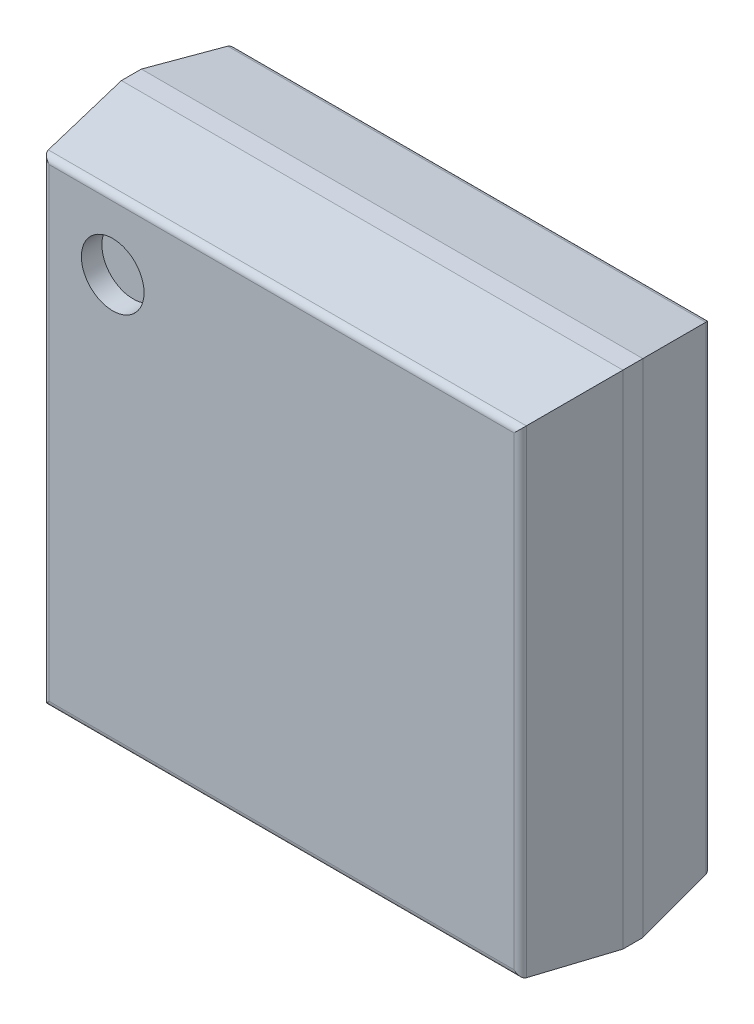
ISO-10303-21;
HEADER;
FILE_DESCRIPTION(('STEP AP214'),'2;1');
FILE_NAME('part.step','',(''),(''),'','','');
FILE_SCHEMA(('AUTOMOTIVE_DESIGN { 1 0 10303 214 1 1 1 1 }'));
ENDSEC;
DATA;
#1=APPLICATION_CONTEXT('core data for automotive mechanical design processes');
#2=APPLICATION_PROTOCOL_DEFINITION('international standard','automotive_design',2000,#1);
#3=PRODUCT_CONTEXT('',#1,'mechanical');
#4=PRODUCT('Part','Part','',(#3));
#5=PRODUCT_RELATED_PRODUCT_CATEGORY('part','',(#4));
#6=PRODUCT_DEFINITION_FORMATION('','',#4);
#7=PRODUCT_DEFINITION_CONTEXT('part definition',#1,'design');
#8=PRODUCT_DEFINITION('design','',#6,#7);
#9=PRODUCT_DEFINITION_SHAPE('','',#8);
#10=(LENGTH_UNIT() NAMED_UNIT(*) SI_UNIT(.MILLI.,.METRE.));
#11=(NAMED_UNIT(*) PLANE_ANGLE_UNIT() SI_UNIT($,.RADIAN.));
#12=(NAMED_UNIT(*) SI_UNIT($,.STERADIAN.) SOLID_ANGLE_UNIT());
#13=UNCERTAINTY_MEASURE_WITH_UNIT(LENGTH_MEASURE(1.E-05),#10,'distance_accuracy_value','');
#14=(GEOMETRIC_REPRESENTATION_CONTEXT(3) GLOBAL_UNCERTAINTY_ASSIGNED_CONTEXT((#13)) GLOBAL_UNIT_ASSIGNED_CONTEXT((#10,
#11,#12)) REPRESENTATION_CONTEXT('',''));
#15=CARTESIAN_POINT('',(0.,0.,0.));
#16=DIRECTION('',(0.,0.,1.));
#17=DIRECTION('',(1.,0.,0.));
#18=AXIS2_PLACEMENT_3D('',#15,#16,#17);
#19=CARTESIAN_POINT('',(-1.77975,1.77975,1.944));
#20=DIRECTION('',(0.,0.,1.));
#21=DIRECTION('',(1.,0.,0.));
#22=AXIS2_PLACEMENT_3D('',#19,#20,#21);
#23=PLANE('',#22);
#24=CARTESIAN_POINT('',(-1.77975,1.77975,1.944));
#25=DIRECTION('',(0.,0.,1.));
#26=DIRECTION('',(1.,0.,0.));
#27=AXIS2_PLACEMENT_3D('',#24,#25,#26);
#28=CIRCLE('',#27,0.3303125);
#29=CARTESIAN_POINT('',(-1.4494375,1.77975,1.944));
#30=VERTEX_POINT('',#29);
#31=EDGE_CURVE('E11',#30,#30,#28,.T.);
#32=ORIENTED_EDGE('',*,*,#31,.T.);
#33=EDGE_LOOP('',(#32));
#34=FACE_BOUND('',#33,.T.);
#35=ADVANCED_FACE('F17',(#34),#23,.T.);
#36=CARTESIAN_POINT('',(-1.77975,1.77975,1.944));
#37=DIRECTION('',(0.,0.,1.));
#38=DIRECTION('',(1.,0.,0.));
#39=AXIS2_PLACEMENT_3D('',#36,#37,#38);
#40=CYLINDRICAL_SURFACE('',#39,0.3303125);
#41=DIRECTION('',(0.,0.,1.));
#42=VECTOR('',#41,1.);
#43=CARTESIAN_POINT('',(-1.4494375,1.77975,1.944));
#44=LINE('',#43,#42);
#45=CARTESIAN_POINT('',(-1.4494375,1.77975,2.16));
#46=VERTEX_POINT('',#45);
#47=EDGE_CURVE('E25',#30,#46,#44,.T.);
#48=ORIENTED_EDGE('',*,*,#47,.T.);
#49=CARTESIAN_POINT('',(-1.77975,1.77975,2.16));
#50=DIRECTION('',(0.,0.,1.));
#51=DIRECTION('',(1.,0.,0.));
#52=AXIS2_PLACEMENT_3D('',#49,#50,#51);
#53=CIRCLE('',#52,0.3303125);
#54=EDGE_CURVE('E216',#46,#46,#53,.T.);
#55=ORIENTED_EDGE('',*,*,#54,.T.);
#56=ORIENTED_EDGE('',*,*,#47,.F.);
#57=ORIENTED_EDGE('',*,*,#31,.F.);
#58=EDGE_LOOP('',(#48,#55,#56,#57));
#59=FACE_BOUND('',#58,.T.);
#60=ADVANCED_FACE('F708',(#59),#40,.F.);
#61=CARTESIAN_POINT('',(2.449399371753,-2.510375,2.09));
#62=DIRECTION('',(0.,1.,0.));
#63=DIRECTION('',(0.,0.,1.));
#64=AXIS2_PLACEMENT_3D('',#61,#62,#63);
#65=CYLINDRICAL_SURFACE('',#64,0.07);
#66=CARTESIAN_POINT('',(2.449399371753,-2.449399371753,2.09));
#67=DIRECTION('',(-0.707106781186548,-0.707106781186548,0.));
#68=DIRECTION('',(0.707106781186548,-0.707106781186548,0.));
#69=AXIS2_PLACEMENT_3D('',#66,#67,#68);
#70=ELLIPSE('',#69,0.09899494936612,0.07);
#71=CARTESIAN_POINT('',(2.518737880459,-2.518737880459,2.099600583856));
#72=VERTEX_POINT('',#71);
#73=CARTESIAN_POINT('',(2.449399371753,-2.449399371753,2.16));
#74=VERTEX_POINT('',#73);
#75=EDGE_CURVE('E192',#72,#74,#70,.T.);
#76=ORIENTED_EDGE('',*,*,#75,.F.);
#77=DIRECTION('',(0.,1.,0.));
#78=VECTOR('',#77,1.);
#79=CARTESIAN_POINT('',(2.518737880459,-2.510375,2.099600583856));
#80=LINE('',#79,#78);
#81=CARTESIAN_POINT('',(2.518737880459,2.518737880459,2.099600583856));
#82=VERTEX_POINT('',#81);
#83=EDGE_CURVE('E189',#72,#82,#80,.T.);
#84=ORIENTED_EDGE('',*,*,#83,.T.);
#85=CARTESIAN_POINT('',(2.449399371753,2.449399371753,2.09));
#86=DIRECTION('',(-0.707106781186548,0.707106781186548,0.));
#87=DIRECTION('',(0.707106781186548,0.707106781186548,0.));
#88=AXIS2_PLACEMENT_3D('',#85,#86,#87);
#89=ELLIPSE('',#88,0.09899494936612,0.07);
#90=CARTESIAN_POINT('',(2.449399371753,2.449399371753,2.16));
#91=VERTEX_POINT('',#90);
#92=EDGE_CURVE('E213',#91,#82,#89,.T.);
#93=ORIENTED_EDGE('',*,*,#92,.F.);
#94=DIRECTION('',(0.,1.,0.));
#95=VECTOR('',#94,1.);
#96=CARTESIAN_POINT('',(2.449399371753,-2.510375,2.16));
#97=LINE('',#96,#95);
#98=EDGE_CURVE('E207',#74,#91,#97,.T.);
#99=ORIENTED_EDGE('',*,*,#98,.F.);
#100=EDGE_LOOP('',(#76,#84,#93,#99));
#101=FACE_BOUND('',#100,.T.);
#102=ADVANCED_FACE('F697',(#101),#65,.T.);
#103=CARTESIAN_POINT('',(-2.510375,2.449399371753,2.09));
#104=DIRECTION('',(1.,0.,0.));
#105=DIRECTION('',(0.,0.,1.));
#106=AXIS2_PLACEMENT_3D('',#103,#104,#105);
#107=CYLINDRICAL_SURFACE('',#106,0.07);
#108=DIRECTION('',(1.,0.,0.));
#109=VECTOR('',#108,1.);
#110=CARTESIAN_POINT('',(-2.510375,2.449399371753,2.16));
#111=LINE('',#110,#109);
#112=CARTESIAN_POINT('',(-2.449399371753,2.449399371753,2.16));
#113=VERTEX_POINT('',#112);
#114=EDGE_CURVE('E210',#113,#91,#111,.T.);
#115=ORIENTED_EDGE('',*,*,#114,.T.);
#116=ORIENTED_EDGE('',*,*,#92,.T.);
#117=DIRECTION('',(1.,0.,0.));
#118=VECTOR('',#117,1.);
#119=CARTESIAN_POINT('',(-2.510375,2.518737880459,2.099600583856));
#120=LINE('',#119,#118);
#121=CARTESIAN_POINT('',(-2.518737880459,2.518737880459,2.099600583856));
#122=VERTEX_POINT('',#121);
#123=EDGE_CURVE('E316',#122,#82,#120,.T.);
#124=ORIENTED_EDGE('',*,*,#123,.F.);
#125=CARTESIAN_POINT('',(-2.449399371753,2.449399371753,2.09));
#126=DIRECTION('',(0.707106781186548,0.707106781186548,0.));
#127=DIRECTION('',(-0.707106781186548,0.707106781186548,0.));
#128=AXIS2_PLACEMENT_3D('',#125,#126,#127);
#129=ELLIPSE('',#128,0.09899494936612,0.07);
#130=EDGE_CURVE('E320',#122,#113,#129,.T.);
#131=ORIENTED_EDGE('',*,*,#130,.T.);
#132=EDGE_LOOP('',(#115,#116,#124,#131));
#133=FACE_BOUND('',#132,.T.);
#134=ADVANCED_FACE('F687',(#133),#107,.T.);
#135=CARTESIAN_POINT('',(-2.6425,-2.6425,2.16));
#136=DIRECTION('',(0.,0.,1.));
#137=DIRECTION('',(1.,0.,0.));
#138=AXIS2_PLACEMENT_3D('',#135,#136,#137);
#139=PLANE('',#138);
#140=ORIENTED_EDGE('',*,*,#54,.F.);
#141=EDGE_LOOP('',(#140));
#142=FACE_BOUND('',#141,.T.);
#143=DIRECTION('',(0.,1.,0.));
#144=VECTOR('',#143,1.);
#145=CARTESIAN_POINT('',(-2.449399371753,-2.510375,2.16));
#146=LINE('',#145,#144);
#147=CARTESIAN_POINT('',(-2.449399371753,-2.449399371753,2.16));
#148=VERTEX_POINT('',#147);
#149=EDGE_CURVE('E283',#148,#113,#146,.T.);
#150=ORIENTED_EDGE('',*,*,#149,.F.);
#151=DIRECTION('',(1.,0.,0.));
#152=VECTOR('',#151,1.);
#153=CARTESIAN_POINT('',(-2.510375,-2.449399371753,2.16));
#154=LINE('',#153,#152);
#155=EDGE_CURVE('E211',#148,#74,#154,.T.);
#156=ORIENTED_EDGE('',*,*,#155,.T.);
#157=ORIENTED_EDGE('',*,*,#98,.T.);
#158=ORIENTED_EDGE('',*,*,#114,.F.);
#159=EDGE_LOOP('',(#150,#156,#157,#158));
#160=FACE_BOUND('',#159,.T.);
#161=ADVANCED_FACE('F676',(#142,#160),#139,.T.);
#162=CARTESIAN_POINT('',(-2.510375,-2.449399371753,2.09));
#163=DIRECTION('',(1.,0.,0.));
#164=DIRECTION('',(0.,-0.990550124377165,0.137151197940023));
#165=AXIS2_PLACEMENT_3D('',#162,#163,#164);
#166=CYLINDRICAL_SURFACE('',#165,0.07);
#167=DIRECTION('',(1.,0.,0.));
#168=VECTOR('',#167,1.);
#169=CARTESIAN_POINT('',(-2.510375,-2.518737880459,2.099600583856));
#170=LINE('',#169,#168);
#171=CARTESIAN_POINT('',(-2.518737880459,-2.518737880459,2.099600583856));
#172=VERTEX_POINT('',#171);
#173=EDGE_CURVE('E263',#172,#72,#170,.T.);
#174=ORIENTED_EDGE('',*,*,#173,.T.);
#175=ORIENTED_EDGE('',*,*,#75,.T.);
#176=ORIENTED_EDGE('',*,*,#155,.F.);
#177=CARTESIAN_POINT('',(-2.449399371753,-2.449399371753,2.09));
#178=DIRECTION('',(-0.707106781186548,0.707106781186548,0.));
#179=DIRECTION('',(0.707106781186548,0.707106781186548,0.));
#180=AXIS2_PLACEMENT_3D('',#177,#178,#179);
#181=ELLIPSE('',#180,0.09899494936612,0.07);
#182=EDGE_CURVE('E267',#172,#148,#181,.T.);
#183=ORIENTED_EDGE('',*,*,#182,.F.);
#184=EDGE_LOOP('',(#174,#175,#176,#183));
#185=FACE_BOUND('',#184,.T.);
#186=ADVANCED_FACE('F665',(#185),#166,.T.);
#187=CARTESIAN_POINT('',(2.5764375,-2.6425,1.682875347978));
#188=DIRECTION('',(0.990550124377165,0.,0.137151197940023));
#189=DIRECTION('',(0.,-1.,0.));
#190=AXIS2_PLACEMENT_3D('',#187,#188,#189);
#191=PLANE('',#190);
#192=DIRECTION('',(-0.135879177577958,0.135879177577958,0.981363183638695));
#193=VECTOR('',#192,1.);
#194=CARTESIAN_POINT('',(2.528868345655,-2.528868345655,2.026435101453));
#195=LINE('',#194,#193);
#196=CARTESIAN_POINT('',(2.6425,-2.6425,1.205750695955));
#197=VERTEX_POINT('',#196);
#198=EDGE_CURVE('E268',#197,#72,#195,.T.);
#199=ORIENTED_EDGE('',*,*,#198,.F.);
#200=DIRECTION('',(0.,1.,0.));
#201=VECTOR('',#200,1.);
#202=CARTESIAN_POINT('',(2.6425,-2.6425,1.205750695955));
#203=LINE('',#202,#201);
#204=CARTESIAN_POINT('',(2.6425,2.6425,1.205750695955));
#205=VERTEX_POINT('',#204);
#206=EDGE_CURVE('E309',#197,#205,#203,.T.);
#207=ORIENTED_EDGE('',*,*,#206,.T.);
#208=DIRECTION('',(-0.135879177577958,-0.135879177577958,0.981363183638695));
#209=VECTOR('',#208,1.);
#210=CARTESIAN_POINT('',(2.480079469403,2.480079469403,2.378804079377));
#211=LINE('',#210,#209);
#212=EDGE_CURVE('E193',#205,#82,#211,.T.);
#213=ORIENTED_EDGE('',*,*,#212,.T.);
#214=ORIENTED_EDGE('',*,*,#83,.F.);
#215=EDGE_LOOP('',(#199,#207,#213,#214));
#216=FACE_BOUND('',#215,.T.);
#217=ADVANCED_FACE('F653',(#216),#191,.T.);
#218=CARTESIAN_POINT('',(-2.6425,2.5764375,1.682875347978));
#219=DIRECTION('',(0.,0.990550124377165,0.137151197940023));
#220=DIRECTION('',(1.,0.,0.));
#221=AXIS2_PLACEMENT_3D('',#218,#219,#220);
#222=PLANE('',#221);
#223=ORIENTED_EDGE('',*,*,#123,.T.);
#224=ORIENTED_EDGE('',*,*,#212,.F.);
#225=DIRECTION('',(1.,0.,0.));
#226=VECTOR('',#225,1.);
#227=CARTESIAN_POINT('',(-2.6425,2.6425,1.205750695955));
#228=LINE('',#227,#226);
#229=CARTESIAN_POINT('',(-2.6425,2.6425,1.205750695955));
#230=VERTEX_POINT('',#229);
#231=EDGE_CURVE('E255',#230,#205,#228,.T.);
#232=ORIENTED_EDGE('',*,*,#231,.F.);
#233=DIRECTION('',(0.135879177577958,-0.135879177577958,0.981363183638695));
#234=VECTOR('',#233,1.);
#235=CARTESIAN_POINT('',(-2.528868345655,2.528868345655,2.026435101453));
#236=LINE('',#235,#234);
#237=EDGE_CURVE('E296',#230,#122,#236,.T.);
#238=ORIENTED_EDGE('',*,*,#237,.T.);
#239=EDGE_LOOP('',(#223,#224,#232,#238));
#240=FACE_BOUND('',#239,.T.);
#241=ADVANCED_FACE('F642',(#240),#222,.T.);
#242=CARTESIAN_POINT('',(-2.449399371753,-2.510375,2.09));
#243=DIRECTION('',(0.,1.,0.));
#244=DIRECTION('',(-0.990550124377165,0.,0.137151197940023));
#245=AXIS2_PLACEMENT_3D('',#242,#243,#244);
#246=CYLINDRICAL_SURFACE('',#245,0.07);
#247=ORIENTED_EDGE('',*,*,#182,.T.);
#248=ORIENTED_EDGE('',*,*,#149,.T.);
#249=ORIENTED_EDGE('',*,*,#130,.F.);
#250=DIRECTION('',(0.,1.,0.));
#251=VECTOR('',#250,1.);
#252=CARTESIAN_POINT('',(-2.518737880459,-2.510375,2.099600583856));
#253=LINE('',#252,#251);
#254=EDGE_CURVE('E203',#172,#122,#253,.T.);
#255=ORIENTED_EDGE('',*,*,#254,.F.);
#256=EDGE_LOOP('',(#247,#248,#249,#255));
#257=FACE_BOUND('',#256,.T.);
#258=ADVANCED_FACE('F631',(#257),#246,.T.);
#259=CARTESIAN_POINT('',(-2.6425,-2.5764375,1.682875347978));
#260=DIRECTION('',(0.,0.990550124377165,-0.137151197940023));
#261=DIRECTION('',(-1.,0.,0.));
#262=AXIS2_PLACEMENT_3D('',#259,#260,#261);
#263=PLANE('',#262);
#264=DIRECTION('',(0.135879177577958,0.135879177577958,0.981363183638695));
#265=VECTOR('',#264,1.);
#266=CARTESIAN_POINT('',(-2.577657221906,-2.577657221906,1.674066123529));
#267=LINE('',#266,#265);
#268=CARTESIAN_POINT('',(-2.6425,-2.6425,1.205750695955));
#269=VERTEX_POINT('',#268);
#270=EDGE_CURVE('E256',#269,#172,#267,.T.);
#271=ORIENTED_EDGE('',*,*,#270,.F.);
#272=DIRECTION('',(1.,0.,0.));
#273=VECTOR('',#272,1.);
#274=CARTESIAN_POINT('',(-2.6425,-2.6425,1.205750695955));
#275=LINE('',#274,#273);
#276=EDGE_CURVE('E148',#269,#197,#275,.T.);
#277=ORIENTED_EDGE('',*,*,#276,.T.);
#278=ORIENTED_EDGE('',*,*,#198,.T.);
#279=ORIENTED_EDGE('',*,*,#173,.F.);
#280=EDGE_LOOP('',(#271,#277,#278,#279));
#281=FACE_BOUND('',#280,.T.);
#282=ADVANCED_FACE('F621',(#281),#263,.F.);
#283=CARTESIAN_POINT('',(2.6425,-2.6425,0.15));
#284=DIRECTION('',(1.,0.,0.));
#285=DIRECTION('',(0.,1.,0.));
#286=AXIS2_PLACEMENT_3D('',#283,#284,#285);
#287=PLANE('',#286);
#288=DIRECTION('',(0.,0.,1.));
#289=VECTOR('',#288,1.);
#290=CARTESIAN_POINT('',(2.6425,-2.6425,0.15));
#291=LINE('',#290,#289);
#292=CARTESIAN_POINT('',(2.6425,-2.6425,0.995750695955));
#293=VERTEX_POINT('',#292);
#294=EDGE_CURVE('E262',#293,#197,#291,.T.);
#295=ORIENTED_EDGE('',*,*,#294,.F.);
#296=DIRECTION('',(0.,1.,0.));
#297=VECTOR('',#296,1.);
#298=CARTESIAN_POINT('',(2.6425,-2.6425,0.995750695955));
#299=LINE('',#298,#297);
#300=CARTESIAN_POINT('',(2.6425,2.6425,0.995750695955));
#301=VERTEX_POINT('',#300);
#302=EDGE_CURVE('E275',#293,#301,#299,.T.);
#303=ORIENTED_EDGE('',*,*,#302,.T.);
#304=DIRECTION('',(0.,0.,1.));
#305=VECTOR('',#304,1.);
#306=CARTESIAN_POINT('',(2.6425,2.6425,0.15));
#307=LINE('',#306,#305);
#308=EDGE_CURVE('E251',#301,#205,#307,.T.);
#309=ORIENTED_EDGE('',*,*,#308,.T.);
#310=ORIENTED_EDGE('',*,*,#206,.F.);
#311=EDGE_LOOP('',(#295,#303,#309,#310));
#312=FACE_BOUND('',#311,.T.);
#313=ADVANCED_FACE('F611',(#312),#287,.T.);
#314=CARTESIAN_POINT('',(2.450461512495,-2.510375,0.22));
#315=DIRECTION('',(0.,1.,0.));
#316=DIRECTION('',(0.,0.,-1.));
#317=AXIS2_PLACEMENT_3D('',#314,#315,#316);
#318=CYLINDRICAL_SURFACE('',#317,0.07);
#319=DIRECTION('',(0.,1.,0.));
#320=VECTOR('',#319,1.);
#321=CARTESIAN_POINT('',(2.450461512495,-2.510375,0.15));
#322=LINE('',#321,#320);
#323=CARTESIAN_POINT('',(2.450461512495,-2.450461512495,0.15));
#324=VERTEX_POINT('',#323);
#325=CARTESIAN_POINT('',(2.450461512495,2.450461512495,0.15));
#326=VERTEX_POINT('',#325);
#327=EDGE_CURVE('E204',#324,#326,#322,.T.);
#328=ORIENTED_EDGE('',*,*,#327,.T.);
#329=CARTESIAN_POINT('',(2.450461512495,2.450461512495,0.22));
#330=DIRECTION('',(0.707106781186548,-0.707106781186548,0.));
#331=DIRECTION('',(0.707106781186548,0.707106781186548,0.));
#332=AXIS2_PLACEMENT_3D('',#329,#330,#331);
#333=ELLIPSE('',#332,0.09899494936612,0.07);
#334=CARTESIAN_POINT('',(2.51962264852,2.51962264852,0.209195497987));
#335=VERTEX_POINT('',#334);
#336=EDGE_CURVE('E200',#326,#335,#333,.T.);
#337=ORIENTED_EDGE('',*,*,#336,.T.);
#338=DIRECTION('',(0.,1.,0.));
#339=VECTOR('',#338,1.);
#340=CARTESIAN_POINT('',(2.51962264852,-2.510375,0.209195497987));
#341=LINE('',#340,#339);
#342=CARTESIAN_POINT('',(2.51962264852,-2.51962264852,0.209195497987));
#343=VERTEX_POINT('',#342);
#344=EDGE_CURVE('E271',#343,#335,#341,.T.);
#345=ORIENTED_EDGE('',*,*,#344,.F.);
#346=CARTESIAN_POINT('',(2.450461512495,-2.450461512495,0.22));
#347=DIRECTION('',(0.707106781186548,0.707106781186548,0.));
#348=DIRECTION('',(0.707106781186548,-0.707106781186548,0.));
#349=AXIS2_PLACEMENT_3D('',#346,#347,#348);
#350=ELLIPSE('',#349,0.09899494936612,0.07);
#351=EDGE_CURVE('E250',#343,#324,#350,.T.);
#352=ORIENTED_EDGE('',*,*,#351,.T.);
#353=EDGE_LOOP('',(#328,#337,#345,#352));
#354=FACE_BOUND('',#353,.T.);
#355=ADVANCED_FACE('F601',(#354),#318,.T.);
#356=CARTESIAN_POINT('',(-2.6425,2.6425,0.15));
#357=DIRECTION('',(0.,1.,0.));
#358=DIRECTION('',(1.,0.,0.));
#359=AXIS2_PLACEMENT_3D('',#356,#357,#358);
#360=PLANE('',#359);
#361=ORIENTED_EDGE('',*,*,#308,.F.);
#362=DIRECTION('',(1.,0.,0.));
#363=VECTOR('',#362,1.);
#364=CARTESIAN_POINT('',(-2.6425,2.6425,0.995750695955));
#365=LINE('',#364,#363);
#366=CARTESIAN_POINT('',(-2.6425,2.6425,0.995750695955));
#367=VERTEX_POINT('',#366);
#368=EDGE_CURVE('E154',#367,#301,#365,.T.);
#369=ORIENTED_EDGE('',*,*,#368,.F.);
#370=DIRECTION('',(0.,0.,1.));
#371=VECTOR('',#370,1.);
#372=CARTESIAN_POINT('',(-2.6425,2.6425,0.15));
#373=LINE('',#372,#371);
#374=EDGE_CURVE('E155',#367,#230,#373,.T.);
#375=ORIENTED_EDGE('',*,*,#374,.T.);
#376=ORIENTED_EDGE('',*,*,#231,.T.);
#377=EDGE_LOOP('',(#361,#369,#375,#376));
#378=FACE_BOUND('',#377,.T.);
#379=ADVANCED_FACE('F591',(#378),#360,.T.);
#380=CARTESIAN_POINT('',(-2.5764375,-2.6425,1.682875347978));
#381=DIRECTION('',(0.990550124377165,0.,-0.137151197940023));
#382=DIRECTION('',(0.,-1.,0.));
#383=AXIS2_PLACEMENT_3D('',#380,#381,#382);
#384=PLANE('',#383);
#385=ORIENTED_EDGE('',*,*,#254,.T.);
#386=ORIENTED_EDGE('',*,*,#237,.F.);
#387=DIRECTION('',(0.,1.,0.));
#388=VECTOR('',#387,1.);
#389=CARTESIAN_POINT('',(-2.6425,-2.6425,1.205750695955));
#390=LINE('',#389,#388);
#391=EDGE_CURVE('E230',#269,#230,#390,.T.);
#392=ORIENTED_EDGE('',*,*,#391,.F.);
#393=ORIENTED_EDGE('',*,*,#270,.T.);
#394=EDGE_LOOP('',(#385,#386,#392,#393));
#395=FACE_BOUND('',#394,.T.);
#396=ADVANCED_FACE('F580',(#395),#384,.F.);
#397=CARTESIAN_POINT('',(-2.510375,2.450461512495,0.22));
#398=DIRECTION('',(1.,0.,0.));
#399=DIRECTION('',(0.,0.,-1.));
#400=AXIS2_PLACEMENT_3D('',#397,#398,#399);
#401=CYLINDRICAL_SURFACE('',#400,0.07);
#402=CARTESIAN_POINT('',(-2.450461512495,2.450461512495,0.22));
#403=DIRECTION('',(-0.707106781186548,-0.707106781186548,0.));
#404=DIRECTION('',(-0.707106781186548,0.707106781186548,0.));
#405=AXIS2_PLACEMENT_3D('',#402,#403,#404);
#406=ELLIPSE('',#405,0.09899494936612,0.07);
#407=CARTESIAN_POINT('',(-2.51962264852,2.51962264852,0.209195497987));
#408=VERTEX_POINT('',#407);
#409=CARTESIAN_POINT('',(-2.450461512495,2.450461512495,0.15));
#410=VERTEX_POINT('',#409);
#411=EDGE_CURVE('E166',#408,#410,#406,.T.);
#412=ORIENTED_EDGE('',*,*,#411,.F.);
#413=DIRECTION('',(1.,0.,0.));
#414=VECTOR('',#413,1.);
#415=CARTESIAN_POINT('',(-2.510375,2.51962264852,0.209195497987));
#416=LINE('',#415,#414);
#417=EDGE_CURVE('E231',#408,#335,#416,.T.);
#418=ORIENTED_EDGE('',*,*,#417,.T.);
#419=ORIENTED_EDGE('',*,*,#336,.F.);
#420=DIRECTION('',(1.,0.,0.));
#421=VECTOR('',#420,1.);
#422=CARTESIAN_POINT('',(-2.510375,2.450461512495,0.15));
#423=LINE('',#422,#421);
#424=EDGE_CURVE('E279',#410,#326,#423,.T.);
#425=ORIENTED_EDGE('',*,*,#424,.F.);
#426=EDGE_LOOP('',(#412,#418,#419,#425));
#427=FACE_BOUND('',#426,.T.);
#428=ADVANCED_FACE('F568',(#427),#401,.T.);
#429=CARTESIAN_POINT('',(-2.6425,-2.6425,0.15));
#430=DIRECTION('',(0.,0.,1.));
#431=DIRECTION('',(1.,0.,0.));
#432=AXIS2_PLACEMENT_3D('',#429,#430,#431);
#433=PLANE('',#432);
#434=ORIENTED_EDGE('',*,*,#424,.T.);
#435=ORIENTED_EDGE('',*,*,#327,.F.);
#436=DIRECTION('',(1.,0.,0.));
#437=VECTOR('',#436,1.);
#438=CARTESIAN_POINT('',(-2.510375,-2.450461512495,0.15));
#439=LINE('',#438,#437);
#440=CARTESIAN_POINT('',(-2.450461512495,-2.450461512495,0.15));
#441=VERTEX_POINT('',#440);
#442=EDGE_CURVE('E235',#441,#324,#439,.T.);
#443=ORIENTED_EDGE('',*,*,#442,.F.);
#444=DIRECTION('',(0.,1.,0.));
#445=VECTOR('',#444,1.);
#446=CARTESIAN_POINT('',(-2.450461512495,-2.510375,0.15));
#447=LINE('',#446,#445);
#448=EDGE_CURVE('E221',#441,#410,#447,.T.);
#449=ORIENTED_EDGE('',*,*,#448,.T.);
#450=EDGE_LOOP('',(#434,#435,#443,#449));
#451=FACE_BOUND('',#450,.T.);
#452=ADVANCED_FACE('F557',(#451),#433,.F.);
#453=CARTESIAN_POINT('',(2.5764375,-2.6425,0.572875347978));
#454=DIRECTION('',(-0.988016228925855,0.,0.154350028762978));
#455=DIRECTION('',(0.,1.,0.));
#456=AXIS2_PLACEMENT_3D('',#453,#454,#455);
#457=PLANE('',#456);
#458=ORIENTED_EDGE('',*,*,#344,.T.);
#459=DIRECTION('',(-0.152543629831963,-0.152543629831963,-0.976453215466762));
#460=VECTOR('',#459,1.);
#461=CARTESIAN_POINT('',(2.454995125915,2.454995125915,-0.204494357989));
#462=LINE('',#461,#460);
#463=EDGE_CURVE('E236',#301,#335,#462,.T.);
#464=ORIENTED_EDGE('',*,*,#463,.F.);
#465=ORIENTED_EDGE('',*,*,#302,.F.);
#466=DIRECTION('',(-0.152543629831963,0.152543629831963,-0.976453215466762));
#467=VECTOR('',#466,1.);
#468=CARTESIAN_POINT('',(2.516484935578,-2.516484935578,0.189110556425));
#469=LINE('',#468,#467);
#470=EDGE_CURVE('E164',#293,#343,#469,.T.);
#471=ORIENTED_EDGE('',*,*,#470,.T.);
#472=EDGE_LOOP('',(#458,#464,#465,#471));
#473=FACE_BOUND('',#472,.T.);
#474=ADVANCED_FACE('F546',(#473),#457,.F.);
#475=CARTESIAN_POINT('',(-2.6425,-2.6425,0.15));
#476=DIRECTION('',(0.,1.,0.));
#477=DIRECTION('',(1.,0.,0.));
#478=AXIS2_PLACEMENT_3D('',#475,#476,#477);
#479=PLANE('',#478);
#480=ORIENTED_EDGE('',*,*,#276,.F.);
#481=DIRECTION('',(0.,0.,1.));
#482=VECTOR('',#481,1.);
#483=CARTESIAN_POINT('',(-2.6425,-2.6425,0.15));
#484=LINE('',#483,#482);
#485=CARTESIAN_POINT('',(-2.6425,-2.6425,0.995750695955));
#486=VERTEX_POINT('',#485);
#487=EDGE_CURVE('E141',#486,#269,#484,.T.);
#488=ORIENTED_EDGE('',*,*,#487,.F.);
#489=DIRECTION('',(1.,0.,0.));
#490=VECTOR('',#489,1.);
#491=CARTESIAN_POINT('',(-2.6425,-2.6425,0.995750695955));
#492=LINE('',#491,#490);
#493=EDGE_CURVE('E145',#486,#293,#492,.T.);
#494=ORIENTED_EDGE('',*,*,#493,.T.);
#495=ORIENTED_EDGE('',*,*,#294,.T.);
#496=EDGE_LOOP('',(#480,#488,#494,#495));
#497=FACE_BOUND('',#496,.T.);
#498=ADVANCED_FACE('F143',(#497),#479,.F.);
#499=CARTESIAN_POINT('',(-2.510375,-2.450461512495,0.22));
#500=DIRECTION('',(1.,0.,0.));
#501=DIRECTION('',(0.,-0.988016228925855,-0.154350028762978));
#502=AXIS2_PLACEMENT_3D('',#499,#500,#501);
#503=CYLINDRICAL_SURFACE('',#502,0.07);
#504=CARTESIAN_POINT('',(-2.450461512495,-2.450461512495,0.22));
#505=DIRECTION('',(0.707106781186548,-0.707106781186548,0.));
#506=DIRECTION('',(0.707106781186548,0.707106781186548,0.));
#507=AXIS2_PLACEMENT_3D('',#504,#505,#506);
#508=ELLIPSE('',#507,0.09899494936612,0.07);
#509=CARTESIAN_POINT('',(-2.51962264852,-2.51962264852,0.209195497987));
#510=VERTEX_POINT('',#509);
#511=EDGE_CURVE('E226',#510,#441,#508,.T.);
#512=ORIENTED_EDGE('',*,*,#511,.T.);
#513=ORIENTED_EDGE('',*,*,#442,.T.);
#514=ORIENTED_EDGE('',*,*,#351,.F.);
#515=DIRECTION('',(1.,0.,0.));
#516=VECTOR('',#515,1.);
#517=CARTESIAN_POINT('',(-2.510375,-2.51962264852,0.209195497987));
#518=LINE('',#517,#516);
#519=EDGE_CURVE('E197',#510,#343,#518,.T.);
#520=ORIENTED_EDGE('',*,*,#519,.F.);
#521=EDGE_LOOP('',(#512,#513,#514,#520));
#522=FACE_BOUND('',#521,.T.);
#523=ADVANCED_FACE('F524',(#522),#503,.T.);
#524=CARTESIAN_POINT('',(-2.6425,2.5764375,0.572875347978));
#525=DIRECTION('',(0.,-0.988016228925855,0.154350028762978));
#526=DIRECTION('',(-1.,0.,0.));
#527=AXIS2_PLACEMENT_3D('',#524,#525,#526);
#528=PLANE('',#527);
#529=DIRECTION('',(0.152543629831963,-0.152543629831963,-0.976453215466762));
#530=VECTOR('',#529,1.);
#531=CARTESIAN_POINT('',(-2.516484935578,2.516484935578,0.189110556425));
#532=LINE('',#531,#530);
#533=EDGE_CURVE('E177',#367,#408,#532,.T.);
#534=ORIENTED_EDGE('',*,*,#533,.F.);
#535=ORIENTED_EDGE('',*,*,#368,.T.);
#536=ORIENTED_EDGE('',*,*,#463,.T.);
#537=ORIENTED_EDGE('',*,*,#417,.F.);
#538=EDGE_LOOP('',(#534,#535,#536,#537));
#539=FACE_BOUND('',#538,.T.);
#540=ADVANCED_FACE('F513',(#539),#528,.F.);
#541=CARTESIAN_POINT('',(-2.6425,-2.6425,0.15));
#542=DIRECTION('',(1.,0.,0.));
#543=DIRECTION('',(0.,1.,0.));
#544=AXIS2_PLACEMENT_3D('',#541,#542,#543);
#545=PLANE('',#544);
#546=ORIENTED_EDGE('',*,*,#391,.T.);
#547=ORIENTED_EDGE('',*,*,#374,.F.);
#548=DIRECTION('',(0.,1.,0.));
#549=VECTOR('',#548,1.);
#550=CARTESIAN_POINT('',(-2.6425,-2.6425,0.995750695955));
#551=LINE('',#550,#549);
#552=EDGE_CURVE('E170',#486,#367,#551,.T.);
#553=ORIENTED_EDGE('',*,*,#552,.F.);
#554=ORIENTED_EDGE('',*,*,#487,.T.);
#555=EDGE_LOOP('',(#546,#547,#553,#554));
#556=FACE_BOUND('',#555,.T.);
#557=ADVANCED_FACE('F171',(#556),#545,.F.);
#558=CARTESIAN_POINT('',(-2.450461512495,-2.510375,0.22));
#559=DIRECTION('',(0.,1.,0.));
#560=DIRECTION('',(-0.988016228925855,0.,-0.154350028762978));
#561=AXIS2_PLACEMENT_3D('',#558,#559,#560);
#562=CYLINDRICAL_SURFACE('',#561,0.07);
#563=DIRECTION('',(0.,1.,0.));
#564=VECTOR('',#563,1.);
#565=CARTESIAN_POINT('',(-2.51962264852,-2.510375,0.209195497987));
#566=LINE('',#565,#564);
#567=EDGE_CURVE('E182',#510,#408,#566,.T.);
#568=ORIENTED_EDGE('',*,*,#567,.T.);
#569=ORIENTED_EDGE('',*,*,#411,.T.);
#570=ORIENTED_EDGE('',*,*,#448,.F.);
#571=ORIENTED_EDGE('',*,*,#511,.F.);
#572=EDGE_LOOP('',(#568,#569,#570,#571));
#573=FACE_BOUND('',#572,.T.);
#574=ADVANCED_FACE('F493',(#573),#562,.T.);
#575=CARTESIAN_POINT('',(-2.6425,-2.5764375,0.572875347978));
#576=DIRECTION('',(0.,-0.988016228925855,-0.154350028762978));
#577=DIRECTION('',(0.,0.154350028762978,-0.988016228925855));
#578=AXIS2_PLACEMENT_3D('',#575,#576,#577);
#579=PLANE('',#578);
#580=ORIENTED_EDGE('',*,*,#519,.T.);
#581=ORIENTED_EDGE('',*,*,#470,.F.);
#582=ORIENTED_EDGE('',*,*,#493,.F.);
#583=DIRECTION('',(0.152543629831963,0.152543629831963,-0.976453215466762));
#584=VECTOR('',#583,1.);
#585=CARTESIAN_POINT('',(-2.577974745242,-2.577974745242,0.582715470838));
#586=LINE('',#585,#584);
#587=EDGE_CURVE('E162',#486,#510,#586,.T.);
#588=ORIENTED_EDGE('',*,*,#587,.T.);
#589=EDGE_LOOP('',(#580,#581,#582,#588));
#590=FACE_BOUND('',#589,.T.);
#591=ADVANCED_FACE('F160',(#590),#579,.T.);
#592=CARTESIAN_POINT('',(-2.5764375,-2.6425,0.572875347978));
#593=DIRECTION('',(-0.988016228925855,0.,-0.154350028762978));
#594=DIRECTION('',(-0.154350028762978,0.,0.988016228925855));
#595=AXIS2_PLACEMENT_3D('',#592,#593,#594);
#596=PLANE('',#595);
#597=ORIENTED_EDGE('',*,*,#587,.F.);
#598=ORIENTED_EDGE('',*,*,#552,.T.);
#599=ORIENTED_EDGE('',*,*,#533,.T.);
#600=ORIENTED_EDGE('',*,*,#567,.F.);
#601=EDGE_LOOP('',(#597,#598,#599,#600));
#602=FACE_BOUND('',#601,.T.);
#603=ADVANCED_FACE('F180',(#602),#596,.T.);
#604=CLOSED_SHELL('',(#35,#60,#102,#134,#161,#186,#217,#241,#258,#282,#313,#355,#379,#396,#428,
#452,#474,#498,#523,#540,#557,#574,#591,#603));
#605=MANIFOLD_SOLID_BREP('B1',#604);
#606=ADVANCED_BREP_SHAPE_REPRESENTATION('',(#18,#605),#14);
#607=SHAPE_DEFINITION_REPRESENTATION(#9,#606);
ENDSEC;
END-ISO-10303-21;
